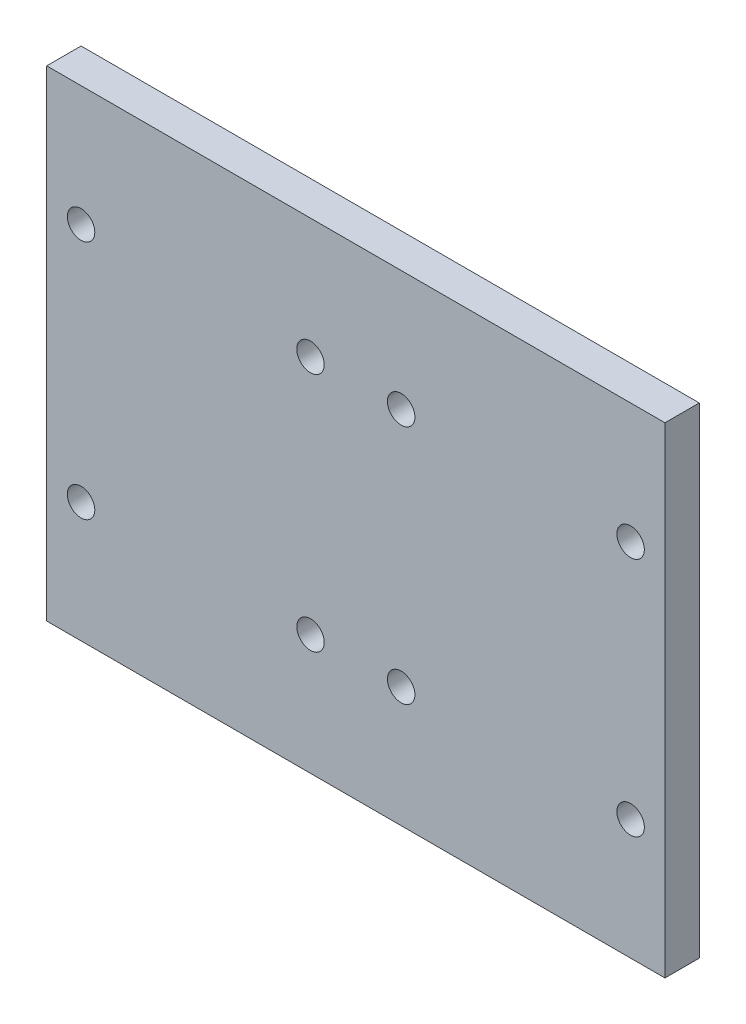
ISO-10303-21;
HEADER;
FILE_DESCRIPTION(('STEP AP214'),'2;1');
FILE_NAME('part.step','',(''),(''),'','','');
FILE_SCHEMA(('AUTOMOTIVE_DESIGN { 1 0 10303 214 1 1 1 1 }'));
ENDSEC;
DATA;
#1=APPLICATION_CONTEXT('core data for automotive mechanical design processes');
#2=APPLICATION_PROTOCOL_DEFINITION('international standard','automotive_design',2000,#1);
#3=PRODUCT_CONTEXT('',#1,'mechanical');
#4=PRODUCT('Part','Part','',(#3));
#5=PRODUCT_RELATED_PRODUCT_CATEGORY('part','',(#4));
#6=PRODUCT_DEFINITION_FORMATION('','',#4);
#7=PRODUCT_DEFINITION_CONTEXT('part definition',#1,'design');
#8=PRODUCT_DEFINITION('design','',#6,#7);
#9=PRODUCT_DEFINITION_SHAPE('','',#8);
#10=(LENGTH_UNIT() NAMED_UNIT(*) SI_UNIT(.MILLI.,.METRE.));
#11=(NAMED_UNIT(*) PLANE_ANGLE_UNIT() SI_UNIT($,.RADIAN.));
#12=(NAMED_UNIT(*) SI_UNIT($,.STERADIAN.) SOLID_ANGLE_UNIT());
#13=UNCERTAINTY_MEASURE_WITH_UNIT(LENGTH_MEASURE(1.E-05),#10,'distance_accuracy_value','');
#14=(GEOMETRIC_REPRESENTATION_CONTEXT(3) GLOBAL_UNCERTAINTY_ASSIGNED_CONTEXT((#13)) GLOBAL_UNIT_ASSIGNED_CONTEXT((#10,
#11,#12)) REPRESENTATION_CONTEXT('',''));
#15=CARTESIAN_POINT('',(0.,0.,0.));
#16=DIRECTION('',(0.,0.,1.));
#17=DIRECTION('',(1.,0.,0.));
#18=AXIS2_PLACEMENT_3D('',#15,#16,#17);
#19=CARTESIAN_POINT('',(0.,0.,5.));
#20=DIRECTION('',(0.,0.,1.));
#21=DIRECTION('',(1.,0.,0.));
#22=AXIS2_PLACEMENT_3D('',#19,#20,#21);
#23=PLANE('',#22);
#24=CARTESIAN_POINT('',(-40.,-17.5,5.));
#25=DIRECTION('',(0.,0.,1.));
#26=DIRECTION('',(1.,0.,0.));
#27=AXIS2_PLACEMENT_3D('',#24,#25,#26);
#28=CIRCLE('',#27,2.);
#29=CARTESIAN_POINT('',(-38.,-17.5,5.));
#30=VERTEX_POINT('',#29);
#31=EDGE_CURVE('E144',#30,#30,#28,.T.);
#32=ORIENTED_EDGE('',*,*,#31,.F.);
#33=EDGE_LOOP('',(#32));
#34=FACE_BOUND('',#33,.T.);
#35=CARTESIAN_POINT('',(-6.6,-17.5,5.));
#36=DIRECTION('',(0.,0.,1.));
#37=DIRECTION('',(1.,0.,0.));
#38=AXIS2_PLACEMENT_3D('',#35,#36,#37);
#39=CIRCLE('',#38,2.);
#40=CARTESIAN_POINT('',(-4.6,-17.5,5.));
#41=VERTEX_POINT('',#40);
#42=EDGE_CURVE('E132',#41,#41,#39,.T.);
#43=ORIENTED_EDGE('',*,*,#42,.F.);
#44=EDGE_LOOP('',(#43));
#45=FACE_BOUND('',#44,.T.);
#46=CARTESIAN_POINT('',(-6.6,17.5,5.));
#47=DIRECTION('',(0.,0.,1.));
#48=DIRECTION('',(1.,0.,0.));
#49=AXIS2_PLACEMENT_3D('',#46,#47,#48);
#50=CIRCLE('',#49,2.);
#51=CARTESIAN_POINT('',(-4.6,17.5,5.));
#52=VERTEX_POINT('',#51);
#53=EDGE_CURVE('E120',#52,#52,#50,.T.);
#54=ORIENTED_EDGE('',*,*,#53,.F.);
#55=EDGE_LOOP('',(#54));
#56=FACE_BOUND('',#55,.T.);
#57=CARTESIAN_POINT('',(6.6,-17.5,5.));
#58=DIRECTION('',(0.,0.,1.));
#59=DIRECTION('',(1.,0.,0.));
#60=AXIS2_PLACEMENT_3D('',#57,#58,#59);
#61=CIRCLE('',#60,2.);
#62=CARTESIAN_POINT('',(8.6,-17.5,5.));
#63=VERTEX_POINT('',#62);
#64=EDGE_CURVE('E99',#63,#63,#61,.T.);
#65=ORIENTED_EDGE('',*,*,#64,.F.);
#66=EDGE_LOOP('',(#65));
#67=FACE_BOUND('',#66,.T.);
#68=DIRECTION('',(0.,1.,0.));
#69=VECTOR('',#68,1.);
#70=CARTESIAN_POINT('',(45.,-35.,5.));
#71=LINE('',#70,#69);
#72=CARTESIAN_POINT('',(45.,-35.,5.));
#73=VERTEX_POINT('',#72);
#74=CARTESIAN_POINT('',(45.,35.,5.));
#75=VERTEX_POINT('',#74);
#76=EDGE_CURVE('E84',#73,#75,#71,.T.);
#77=ORIENTED_EDGE('',*,*,#76,.T.);
#78=DIRECTION('',(-1.,0.,0.));
#79=VECTOR('',#78,1.);
#80=CARTESIAN_POINT('',(45.,35.,5.));
#81=LINE('',#80,#79);
#82=CARTESIAN_POINT('',(-45.,35.,5.));
#83=VERTEX_POINT('',#82);
#84=EDGE_CURVE('E79',#75,#83,#81,.T.);
#85=ORIENTED_EDGE('',*,*,#84,.T.);
#86=DIRECTION('',(0.,-1.,0.));
#87=VECTOR('',#86,1.);
#88=CARTESIAN_POINT('',(-45.,35.,5.));
#89=LINE('',#88,#87);
#90=CARTESIAN_POINT('',(-45.,-35.,5.));
#91=VERTEX_POINT('',#90);
#92=EDGE_CURVE('E82',#83,#91,#89,.T.);
#93=ORIENTED_EDGE('',*,*,#92,.T.);
#94=DIRECTION('',(1.,0.,0.));
#95=VECTOR('',#94,1.);
#96=CARTESIAN_POINT('',(-45.,-35.,5.));
#97=LINE('',#96,#95);
#98=EDGE_CURVE('E49',#91,#73,#97,.T.);
#99=ORIENTED_EDGE('',*,*,#98,.T.);
#100=EDGE_LOOP('',(#77,#85,#93,#99));
#101=FACE_BOUND('',#100,.T.);
#102=CARTESIAN_POINT('',(40.,-17.5,5.));
#103=DIRECTION('',(0.,0.,1.));
#104=DIRECTION('',(1.,0.,0.));
#105=AXIS2_PLACEMENT_3D('',#102,#103,#104);
#106=CIRCLE('',#105,2.);
#107=CARTESIAN_POINT('',(42.,-17.5,5.));
#108=VERTEX_POINT('',#107);
#109=EDGE_CURVE('E114',#108,#108,#106,.T.);
#110=ORIENTED_EDGE('',*,*,#109,.F.);
#111=EDGE_LOOP('',(#110));
#112=FACE_BOUND('',#111,.T.);
#113=CARTESIAN_POINT('',(6.6,17.5,5.));
#114=DIRECTION('',(0.,0.,1.));
#115=DIRECTION('',(1.,0.,0.));
#116=AXIS2_PLACEMENT_3D('',#113,#114,#115);
#117=CIRCLE('',#116,2.);
#118=CARTESIAN_POINT('',(8.6,17.5,5.));
#119=VERTEX_POINT('',#118);
#120=EDGE_CURVE('E126',#119,#119,#117,.T.);
#121=ORIENTED_EDGE('',*,*,#120,.F.);
#122=EDGE_LOOP('',(#121));
#123=FACE_BOUND('',#122,.T.);
#124=CARTESIAN_POINT('',(-40.,17.5,5.));
#125=DIRECTION('',(0.,0.,1.));
#126=DIRECTION('',(1.,0.,0.));
#127=AXIS2_PLACEMENT_3D('',#124,#125,#126);
#128=CIRCLE('',#127,2.);
#129=CARTESIAN_POINT('',(-38.,17.5,5.));
#130=VERTEX_POINT('',#129);
#131=EDGE_CURVE('E138',#130,#130,#128,.T.);
#132=ORIENTED_EDGE('',*,*,#131,.F.);
#133=EDGE_LOOP('',(#132));
#134=FACE_BOUND('',#133,.T.);
#135=CARTESIAN_POINT('',(40.,17.5,5.));
#136=DIRECTION('',(0.,0.,1.));
#137=DIRECTION('',(1.,0.,0.));
#138=AXIS2_PLACEMENT_3D('',#135,#136,#137);
#139=CIRCLE('',#138,2.);
#140=CARTESIAN_POINT('',(42.,17.5,5.));
#141=VERTEX_POINT('',#140);
#142=EDGE_CURVE('E150',#141,#141,#139,.T.);
#143=ORIENTED_EDGE('',*,*,#142,.F.);
#144=EDGE_LOOP('',(#143));
#145=FACE_BOUND('',#144,.T.);
#146=ADVANCED_FACE('F32',(#34,#45,#56,#67,#101,#112,#123,#134,#145),#23,.T.);
#147=CARTESIAN_POINT('',(0.,0.,0.));
#148=DIRECTION('',(0.,0.,1.));
#149=DIRECTION('',(1.,0.,0.));
#150=AXIS2_PLACEMENT_3D('',#147,#148,#149);
#151=PLANE('',#150);
#152=DIRECTION('',(0.,1.,0.));
#153=VECTOR('',#152,1.);
#154=CARTESIAN_POINT('',(45.,-35.,0.));
#155=LINE('',#154,#153);
#156=CARTESIAN_POINT('',(45.,-35.,0.));
#157=VERTEX_POINT('',#156);
#158=CARTESIAN_POINT('',(45.,35.,0.));
#159=VERTEX_POINT('',#158);
#160=EDGE_CURVE('E96',#157,#159,#155,.T.);
#161=ORIENTED_EDGE('',*,*,#160,.F.);
#162=DIRECTION('',(1.,0.,0.));
#163=VECTOR('',#162,1.);
#164=CARTESIAN_POINT('',(-45.,-35.,0.));
#165=LINE('',#164,#163);
#166=CARTESIAN_POINT('',(-45.,-35.,0.));
#167=VERTEX_POINT('',#166);
#168=EDGE_CURVE('E72',#167,#157,#165,.T.);
#169=ORIENTED_EDGE('',*,*,#168,.F.);
#170=DIRECTION('',(0.,-1.,0.));
#171=VECTOR('',#170,1.);
#172=CARTESIAN_POINT('',(-45.,35.,0.));
#173=LINE('',#172,#171);
#174=CARTESIAN_POINT('',(-45.,35.,0.));
#175=VERTEX_POINT('',#174);
#176=EDGE_CURVE('E66',#175,#167,#173,.T.);
#177=ORIENTED_EDGE('',*,*,#176,.F.);
#178=DIRECTION('',(-1.,0.,0.));
#179=VECTOR('',#178,1.);
#180=CARTESIAN_POINT('',(45.,35.,0.));
#181=LINE('',#180,#179);
#182=EDGE_CURVE('E88',#159,#175,#181,.T.);
#183=ORIENTED_EDGE('',*,*,#182,.F.);
#184=EDGE_LOOP('',(#161,#169,#177,#183));
#185=FACE_BOUND('',#184,.T.);
#186=CARTESIAN_POINT('',(6.6,-17.5,0.));
#187=DIRECTION('',(0.,0.,1.));
#188=DIRECTION('',(1.,0.,0.));
#189=AXIS2_PLACEMENT_3D('',#186,#187,#188);
#190=CIRCLE('',#189,2.);
#191=CARTESIAN_POINT('',(8.6,-17.5,0.));
#192=VERTEX_POINT('',#191);
#193=EDGE_CURVE('E111',#192,#192,#190,.T.);
#194=ORIENTED_EDGE('',*,*,#193,.T.);
#195=EDGE_LOOP('',(#194));
#196=FACE_BOUND('',#195,.T.);
#197=CARTESIAN_POINT('',(40.,-17.5,0.));
#198=DIRECTION('',(0.,0.,1.));
#199=DIRECTION('',(1.,0.,0.));
#200=AXIS2_PLACEMENT_3D('',#197,#198,#199);
#201=CIRCLE('',#200,2.);
#202=CARTESIAN_POINT('',(42.,-17.5,0.));
#203=VERTEX_POINT('',#202);
#204=EDGE_CURVE('E117',#203,#203,#201,.T.);
#205=ORIENTED_EDGE('',*,*,#204,.T.);
#206=EDGE_LOOP('',(#205));
#207=FACE_BOUND('',#206,.T.);
#208=CARTESIAN_POINT('',(-6.6,17.5,0.));
#209=DIRECTION('',(0.,0.,1.));
#210=DIRECTION('',(1.,0.,0.));
#211=AXIS2_PLACEMENT_3D('',#208,#209,#210);
#212=CIRCLE('',#211,2.);
#213=CARTESIAN_POINT('',(-4.6,17.5,0.));
#214=VERTEX_POINT('',#213);
#215=EDGE_CURVE('E123',#214,#214,#212,.T.);
#216=ORIENTED_EDGE('',*,*,#215,.T.);
#217=EDGE_LOOP('',(#216));
#218=FACE_BOUND('',#217,.T.);
#219=CARTESIAN_POINT('',(6.6,17.5,0.));
#220=DIRECTION('',(0.,0.,1.));
#221=DIRECTION('',(1.,0.,0.));
#222=AXIS2_PLACEMENT_3D('',#219,#220,#221);
#223=CIRCLE('',#222,2.);
#224=CARTESIAN_POINT('',(8.6,17.5,0.));
#225=VERTEX_POINT('',#224);
#226=EDGE_CURVE('E129',#225,#225,#223,.T.);
#227=ORIENTED_EDGE('',*,*,#226,.T.);
#228=EDGE_LOOP('',(#227));
#229=FACE_BOUND('',#228,.T.);
#230=CARTESIAN_POINT('',(-6.6,-17.5,0.));
#231=DIRECTION('',(0.,0.,1.));
#232=DIRECTION('',(1.,0.,0.));
#233=AXIS2_PLACEMENT_3D('',#230,#231,#232);
#234=CIRCLE('',#233,2.);
#235=CARTESIAN_POINT('',(-4.6,-17.5,0.));
#236=VERTEX_POINT('',#235);
#237=EDGE_CURVE('E135',#236,#236,#234,.T.);
#238=ORIENTED_EDGE('',*,*,#237,.T.);
#239=EDGE_LOOP('',(#238));
#240=FACE_BOUND('',#239,.T.);
#241=CARTESIAN_POINT('',(-40.,17.5,0.));
#242=DIRECTION('',(0.,0.,1.));
#243=DIRECTION('',(1.,0.,0.));
#244=AXIS2_PLACEMENT_3D('',#241,#242,#243);
#245=CIRCLE('',#244,2.);
#246=CARTESIAN_POINT('',(-38.,17.5,0.));
#247=VERTEX_POINT('',#246);
#248=EDGE_CURVE('E141',#247,#247,#245,.T.);
#249=ORIENTED_EDGE('',*,*,#248,.T.);
#250=EDGE_LOOP('',(#249));
#251=FACE_BOUND('',#250,.T.);
#252=CARTESIAN_POINT('',(-40.,-17.5,0.));
#253=DIRECTION('',(0.,0.,1.));
#254=DIRECTION('',(1.,0.,0.));
#255=AXIS2_PLACEMENT_3D('',#252,#253,#254);
#256=CIRCLE('',#255,2.);
#257=CARTESIAN_POINT('',(-38.,-17.5,0.));
#258=VERTEX_POINT('',#257);
#259=EDGE_CURVE('E147',#258,#258,#256,.T.);
#260=ORIENTED_EDGE('',*,*,#259,.T.);
#261=EDGE_LOOP('',(#260));
#262=FACE_BOUND('',#261,.T.);
#263=CARTESIAN_POINT('',(40.,17.5,0.));
#264=DIRECTION('',(0.,0.,1.));
#265=DIRECTION('',(1.,0.,0.));
#266=AXIS2_PLACEMENT_3D('',#263,#264,#265);
#267=CIRCLE('',#266,2.);
#268=CARTESIAN_POINT('',(42.,17.5,0.));
#269=VERTEX_POINT('',#268);
#270=EDGE_CURVE('E153',#269,#269,#267,.T.);
#271=ORIENTED_EDGE('',*,*,#270,.T.);
#272=EDGE_LOOP('',(#271));
#273=FACE_BOUND('',#272,.T.);
#274=ADVANCED_FACE('F107',(#185,#196,#207,#218,#229,#240,#251,#262,#273),#151,.F.);
#275=CARTESIAN_POINT('',(45.,-35.,5.));
#276=DIRECTION('',(-1.,0.,0.));
#277=DIRECTION('',(0.,0.,1.));
#278=AXIS2_PLACEMENT_3D('',#275,#276,#277);
#279=PLANE('',#278);
#280=ORIENTED_EDGE('',*,*,#160,.T.);
#281=DIRECTION('',(0.,0.,-1.));
#282=VECTOR('',#281,1.);
#283=CARTESIAN_POINT('',(45.,35.,5.));
#284=LINE('',#283,#282);
#285=EDGE_CURVE('E11',#75,#159,#284,.T.);
#286=ORIENTED_EDGE('',*,*,#285,.F.);
#287=ORIENTED_EDGE('',*,*,#76,.F.);
#288=DIRECTION('',(0.,0.,-1.));
#289=VECTOR('',#288,1.);
#290=CARTESIAN_POINT('',(45.,-35.,5.));
#291=LINE('',#290,#289);
#292=EDGE_CURVE('E92',#73,#157,#291,.T.);
#293=ORIENTED_EDGE('',*,*,#292,.T.);
#294=EDGE_LOOP('',(#280,#286,#287,#293));
#295=FACE_BOUND('',#294,.T.);
#296=ADVANCED_FACE('F34',(#295),#279,.F.);
#297=CARTESIAN_POINT('',(45.,35.,5.));
#298=DIRECTION('',(0.,-1.,0.));
#299=DIRECTION('',(1.,0.,0.));
#300=AXIS2_PLACEMENT_3D('',#297,#298,#299);
#301=PLANE('',#300);
#302=ORIENTED_EDGE('',*,*,#182,.T.);
#303=DIRECTION('',(0.,0.,-1.));
#304=VECTOR('',#303,1.);
#305=CARTESIAN_POINT('',(-45.,35.,5.));
#306=LINE('',#305,#304);
#307=EDGE_CURVE('E41',#83,#175,#306,.T.);
#308=ORIENTED_EDGE('',*,*,#307,.F.);
#309=ORIENTED_EDGE('',*,*,#84,.F.);
#310=ORIENTED_EDGE('',*,*,#285,.T.);
#311=EDGE_LOOP('',(#302,#308,#309,#310));
#312=FACE_BOUND('',#311,.T.);
#313=ADVANCED_FACE('F87',(#312),#301,.F.);
#314=CARTESIAN_POINT('',(-45.,35.,5.));
#315=DIRECTION('',(1.,0.,0.));
#316=DIRECTION('',(0.,1.,0.));
#317=AXIS2_PLACEMENT_3D('',#314,#315,#316);
#318=PLANE('',#317);
#319=ORIENTED_EDGE('',*,*,#176,.T.);
#320=DIRECTION('',(0.,0.,-1.));
#321=VECTOR('',#320,1.);
#322=CARTESIAN_POINT('',(-45.,-35.,5.));
#323=LINE('',#322,#321);
#324=EDGE_CURVE('E89',#91,#167,#323,.T.);
#325=ORIENTED_EDGE('',*,*,#324,.F.);
#326=ORIENTED_EDGE('',*,*,#92,.F.);
#327=ORIENTED_EDGE('',*,*,#307,.T.);
#328=EDGE_LOOP('',(#319,#325,#326,#327));
#329=FACE_BOUND('',#328,.T.);
#330=ADVANCED_FACE('F90',(#329),#318,.F.);
#331=CARTESIAN_POINT('',(-45.,-35.,5.));
#332=DIRECTION('',(0.,1.,0.));
#333=DIRECTION('',(-1.,0.,0.));
#334=AXIS2_PLACEMENT_3D('',#331,#332,#333);
#335=PLANE('',#334);
#336=ORIENTED_EDGE('',*,*,#168,.T.);
#337=ORIENTED_EDGE('',*,*,#292,.F.);
#338=ORIENTED_EDGE('',*,*,#98,.F.);
#339=ORIENTED_EDGE('',*,*,#324,.T.);
#340=EDGE_LOOP('',(#336,#337,#338,#339));
#341=FACE_BOUND('',#340,.T.);
#342=ADVANCED_FACE('F104',(#341),#335,.F.);
#343=CARTESIAN_POINT('',(6.6,-17.5,5.));
#344=DIRECTION('',(0.,0.,-1.));
#345=DIRECTION('',(-1.,0.,0.));
#346=AXIS2_PLACEMENT_3D('',#343,#344,#345);
#347=CYLINDRICAL_SURFACE('',#346,2.);
#348=ORIENTED_EDGE('',*,*,#64,.T.);
#349=EDGE_LOOP('',(#348));
#350=FACE_BOUND('',#349,.T.);
#351=ORIENTED_EDGE('',*,*,#193,.F.);
#352=EDGE_LOOP('',(#351));
#353=FACE_BOUND('',#352,.T.);
#354=ADVANCED_FACE('F172',(#350,#353),#347,.F.);
#355=CARTESIAN_POINT('',(40.,-17.5,5.));
#356=DIRECTION('',(0.,0.,-1.));
#357=DIRECTION('',(-1.,0.,0.));
#358=AXIS2_PLACEMENT_3D('',#355,#356,#357);
#359=CYLINDRICAL_SURFACE('',#358,2.);
#360=ORIENTED_EDGE('',*,*,#109,.T.);
#361=EDGE_LOOP('',(#360));
#362=FACE_BOUND('',#361,.T.);
#363=ORIENTED_EDGE('',*,*,#204,.F.);
#364=EDGE_LOOP('',(#363));
#365=FACE_BOUND('',#364,.T.);
#366=ADVANCED_FACE('F218',(#362,#365),#359,.F.);
#367=CARTESIAN_POINT('',(-6.6,17.5,5.));
#368=DIRECTION('',(0.,0.,-1.));
#369=DIRECTION('',(-1.,0.,0.));
#370=AXIS2_PLACEMENT_3D('',#367,#368,#369);
#371=CYLINDRICAL_SURFACE('',#370,2.);
#372=ORIENTED_EDGE('',*,*,#53,.T.);
#373=EDGE_LOOP('',(#372));
#374=FACE_BOUND('',#373,.T.);
#375=ORIENTED_EDGE('',*,*,#215,.F.);
#376=EDGE_LOOP('',(#375));
#377=FACE_BOUND('',#376,.T.);
#378=ADVANCED_FACE('F226',(#374,#377),#371,.F.);
#379=CARTESIAN_POINT('',(6.6,17.5,5.));
#380=DIRECTION('',(0.,0.,-1.));
#381=DIRECTION('',(-1.,0.,0.));
#382=AXIS2_PLACEMENT_3D('',#379,#380,#381);
#383=CYLINDRICAL_SURFACE('',#382,2.);
#384=ORIENTED_EDGE('',*,*,#120,.T.);
#385=EDGE_LOOP('',(#384));
#386=FACE_BOUND('',#385,.T.);
#387=ORIENTED_EDGE('',*,*,#226,.F.);
#388=EDGE_LOOP('',(#387));
#389=FACE_BOUND('',#388,.T.);
#390=ADVANCED_FACE('F234',(#386,#389),#383,.F.);
#391=CARTESIAN_POINT('',(-6.6,-17.5,5.));
#392=DIRECTION('',(0.,0.,-1.));
#393=DIRECTION('',(-1.,0.,0.));
#394=AXIS2_PLACEMENT_3D('',#391,#392,#393);
#395=CYLINDRICAL_SURFACE('',#394,2.);
#396=ORIENTED_EDGE('',*,*,#42,.T.);
#397=EDGE_LOOP('',(#396));
#398=FACE_BOUND('',#397,.T.);
#399=ORIENTED_EDGE('',*,*,#237,.F.);
#400=EDGE_LOOP('',(#399));
#401=FACE_BOUND('',#400,.T.);
#402=ADVANCED_FACE('F243',(#398,#401),#395,.F.);
#403=CARTESIAN_POINT('',(-40.,17.5,5.));
#404=DIRECTION('',(0.,0.,-1.));
#405=DIRECTION('',(-1.,0.,0.));
#406=AXIS2_PLACEMENT_3D('',#403,#404,#405);
#407=CYLINDRICAL_SURFACE('',#406,2.);
#408=ORIENTED_EDGE('',*,*,#131,.T.);
#409=EDGE_LOOP('',(#408));
#410=FACE_BOUND('',#409,.T.);
#411=ORIENTED_EDGE('',*,*,#248,.F.);
#412=EDGE_LOOP('',(#411));
#413=FACE_BOUND('',#412,.T.);
#414=ADVANCED_FACE('F252',(#410,#413),#407,.F.);
#415=CARTESIAN_POINT('',(-40.,-17.5,5.));
#416=DIRECTION('',(0.,0.,-1.));
#417=DIRECTION('',(-1.,0.,0.));
#418=AXIS2_PLACEMENT_3D('',#415,#416,#417);
#419=CYLINDRICAL_SURFACE('',#418,2.);
#420=ORIENTED_EDGE('',*,*,#31,.T.);
#421=EDGE_LOOP('',(#420));
#422=FACE_BOUND('',#421,.T.);
#423=ORIENTED_EDGE('',*,*,#259,.F.);
#424=EDGE_LOOP('',(#423));
#425=FACE_BOUND('',#424,.T.);
#426=ADVANCED_FACE('F261',(#422,#425),#419,.F.);
#427=CARTESIAN_POINT('',(40.,17.5,5.));
#428=DIRECTION('',(0.,0.,-1.));
#429=DIRECTION('',(-1.,0.,0.));
#430=AXIS2_PLACEMENT_3D('',#427,#428,#429);
#431=CYLINDRICAL_SURFACE('',#430,2.);
#432=ORIENTED_EDGE('',*,*,#142,.T.);
#433=EDGE_LOOP('',(#432));
#434=FACE_BOUND('',#433,.T.);
#435=ORIENTED_EDGE('',*,*,#270,.F.);
#436=EDGE_LOOP('',(#435));
#437=FACE_BOUND('',#436,.T.);
#438=ADVANCED_FACE('F159',(#434,#437),#431,.F.);
#439=CLOSED_SHELL('',(#146,#274,#296,#313,#330,#342,#354,#366,#378,#390,#402,#414,#426,#438));
#440=MANIFOLD_SOLID_BREP('B2',#439);
#441=ADVANCED_BREP_SHAPE_REPRESENTATION('',(#18,#440),#14);
#442=SHAPE_DEFINITION_REPRESENTATION(#9,#441);
ENDSEC;
END-ISO-10303-21;
